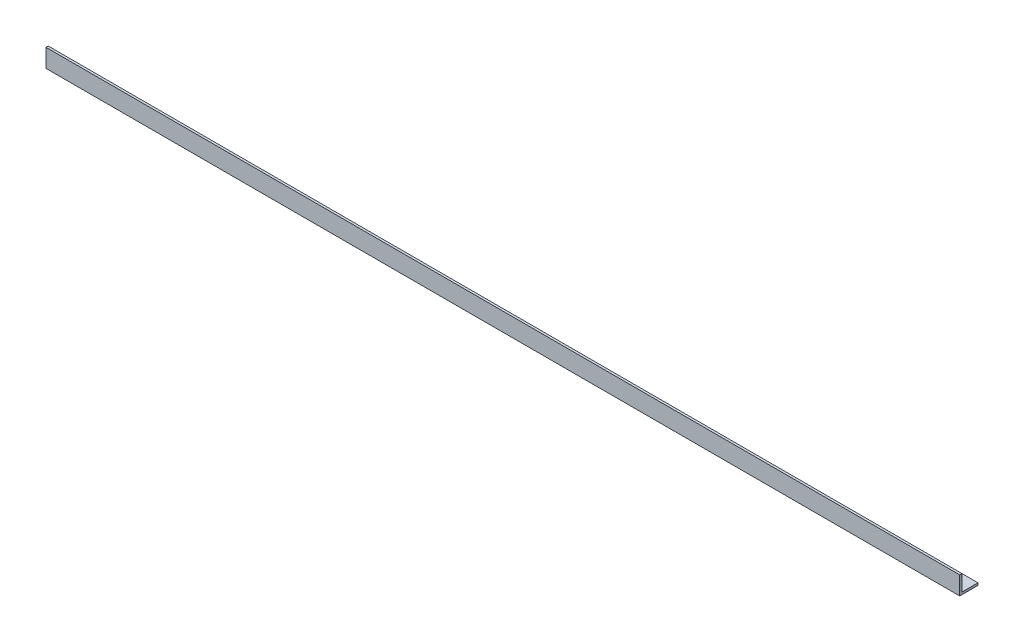
ISO-10303-21;
HEADER;
FILE_DESCRIPTION(('STEP AP214'),'2;1');
FILE_NAME('part.step','',(''),(''),'','','');
FILE_SCHEMA(('AUTOMOTIVE_DESIGN { 1 0 10303 214 1 1 1 1 }'));
ENDSEC;
DATA;
#1=APPLICATION_CONTEXT('core data for automotive mechanical design processes');
#2=APPLICATION_PROTOCOL_DEFINITION('international standard','automotive_design',2000,#1);
#3=PRODUCT_CONTEXT('',#1,'mechanical');
#4=PRODUCT('Part','Part','',(#3));
#5=PRODUCT_RELATED_PRODUCT_CATEGORY('part','',(#4));
#6=PRODUCT_DEFINITION_FORMATION('','',#4);
#7=PRODUCT_DEFINITION_CONTEXT('part definition',#1,'design');
#8=PRODUCT_DEFINITION('design','',#6,#7);
#9=PRODUCT_DEFINITION_SHAPE('','',#8);
#10=(LENGTH_UNIT() NAMED_UNIT(*) SI_UNIT(.MILLI.,.METRE.));
#11=(NAMED_UNIT(*) PLANE_ANGLE_UNIT() SI_UNIT($,.RADIAN.));
#12=(NAMED_UNIT(*) SI_UNIT($,.STERADIAN.) SOLID_ANGLE_UNIT());
#13=UNCERTAINTY_MEASURE_WITH_UNIT(LENGTH_MEASURE(1.E-05),#10,'distance_accuracy_value','');
#14=(GEOMETRIC_REPRESENTATION_CONTEXT(3) GLOBAL_UNCERTAINTY_ASSIGNED_CONTEXT((#13)) GLOBAL_UNIT_ASSIGNED_CONTEXT((#10,
#11,#12)) REPRESENTATION_CONTEXT('',''));
#15=CARTESIAN_POINT('',(0.,0.,0.));
#16=DIRECTION('',(0.,0.,1.));
#17=DIRECTION('',(1.,0.,0.));
#18=AXIS2_PLACEMENT_3D('',#15,#16,#17);
#19=CARTESIAN_POINT('',(-635.,3.175,-25.4));
#20=DIRECTION('',(0.,1.,0.));
#21=DIRECTION('',(0.,0.,1.));
#22=AXIS2_PLACEMENT_3D('',#19,#20,#21);
#23=PLANE('',#22);
#24=DIRECTION('',(-1.,0.,0.));
#25=VECTOR('',#24,1.);
#26=CARTESIAN_POINT('',(-635.,3.175,-25.4));
#27=LINE('',#26,#25);
#28=CARTESIAN_POINT('',(-635.,3.175,-25.4));
#29=VERTEX_POINT('',#28);
#30=CARTESIAN_POINT('',(635.,3.175,-25.4));
#31=VERTEX_POINT('',#30);
#32=EDGE_CURVE('E72',#29,#31,#27,.F.);
#33=ORIENTED_EDGE('',*,*,#32,.F.);
#34=DIRECTION('',(0.,0.,-1.));
#35=VECTOR('',#34,1.);
#36=CARTESIAN_POINT('',(-635.,3.175,0.));
#37=LINE('',#36,#35);
#38=CARTESIAN_POINT('',(-635.,3.175,-3.175));
#39=VERTEX_POINT('',#38);
#40=EDGE_CURVE('E104',#29,#39,#37,.F.);
#41=ORIENTED_EDGE('',*,*,#40,.T.);
#42=DIRECTION('',(-1.,0.,0.));
#43=VECTOR('',#42,1.);
#44=CARTESIAN_POINT('',(-635.,3.175,-3.175));
#45=LINE('',#44,#43);
#46=CARTESIAN_POINT('',(635.,3.175,-3.175));
#47=VERTEX_POINT('',#46);
#48=EDGE_CURVE('E20',#47,#39,#45,.T.);
#49=ORIENTED_EDGE('',*,*,#48,.F.);
#50=DIRECTION('',(0.,0.,-1.));
#51=VECTOR('',#50,1.);
#52=CARTESIAN_POINT('',(635.,3.175,0.));
#53=LINE('',#52,#51);
#54=EDGE_CURVE('E83',#31,#47,#53,.F.);
#55=ORIENTED_EDGE('',*,*,#54,.F.);
#56=EDGE_LOOP('',(#33,#41,#49,#55));
#57=FACE_BOUND('',#56,.T.);
#58=ADVANCED_FACE('F17',(#57),#23,.T.);
#59=CARTESIAN_POINT('',(-635.,3.175,-3.175));
#60=DIRECTION('',(0.,0.,-1.));
#61=DIRECTION('',(-1.,0.,0.));
#62=AXIS2_PLACEMENT_3D('',#59,#60,#61);
#63=PLANE('',#62);
#64=ORIENTED_EDGE('',*,*,#48,.T.);
#65=DIRECTION('',(0.,1.,0.));
#66=VECTOR('',#65,1.);
#67=CARTESIAN_POINT('',(-635.,0.,-3.175));
#68=LINE('',#67,#66);
#69=CARTESIAN_POINT('',(-635.,25.4,-3.175));
#70=VERTEX_POINT('',#69);
#71=EDGE_CURVE('E101',#39,#70,#68,.T.);
#72=ORIENTED_EDGE('',*,*,#71,.T.);
#73=DIRECTION('',(1.,0.,0.));
#74=VECTOR('',#73,1.);
#75=CARTESIAN_POINT('',(-635.,25.4,-3.175));
#76=LINE('',#75,#74);
#77=CARTESIAN_POINT('',(635.,25.4,-3.175));
#78=VERTEX_POINT('',#77);
#79=EDGE_CURVE('E80',#78,#70,#76,.F.);
#80=ORIENTED_EDGE('',*,*,#79,.F.);
#81=DIRECTION('',(0.,1.,0.));
#82=VECTOR('',#81,1.);
#83=CARTESIAN_POINT('',(635.,0.,-3.175));
#84=LINE('',#83,#82);
#85=EDGE_CURVE('E86',#47,#78,#84,.T.);
#86=ORIENTED_EDGE('',*,*,#85,.F.);
#87=EDGE_LOOP('',(#64,#72,#80,#86));
#88=FACE_BOUND('',#87,.T.);
#89=ADVANCED_FACE('F100',(#88),#63,.T.);
#90=CARTESIAN_POINT('',(-635.,25.4,-3.175));
#91=DIRECTION('',(0.,1.,0.));
#92=DIRECTION('',(0.,0.,1.));
#93=AXIS2_PLACEMENT_3D('',#90,#91,#92);
#94=PLANE('',#93);
#95=ORIENTED_EDGE('',*,*,#79,.T.);
#96=DIRECTION('',(0.,0.,-1.));
#97=VECTOR('',#96,1.);
#98=CARTESIAN_POINT('',(-635.,25.4,0.));
#99=LINE('',#98,#97);
#100=CARTESIAN_POINT('',(-635.,25.4,0.));
#101=VERTEX_POINT('',#100);
#102=EDGE_CURVE('E105',#70,#101,#99,.F.);
#103=ORIENTED_EDGE('',*,*,#102,.T.);
#104=DIRECTION('',(1.,0.,0.));
#105=VECTOR('',#104,1.);
#106=CARTESIAN_POINT('',(-635.,25.4,0.));
#107=LINE('',#106,#105);
#108=CARTESIAN_POINT('',(635.,25.4,0.));
#109=VERTEX_POINT('',#108);
#110=EDGE_CURVE('E112',#109,#101,#107,.F.);
#111=ORIENTED_EDGE('',*,*,#110,.F.);
#112=DIRECTION('',(0.,0.,-1.));
#113=VECTOR('',#112,1.);
#114=CARTESIAN_POINT('',(635.,25.4,0.));
#115=LINE('',#114,#113);
#116=EDGE_CURVE('E117',#78,#109,#115,.F.);
#117=ORIENTED_EDGE('',*,*,#116,.F.);
#118=EDGE_LOOP('',(#95,#103,#111,#117));
#119=FACE_BOUND('',#118,.T.);
#120=ADVANCED_FACE('F119',(#119),#94,.T.);
#121=CARTESIAN_POINT('',(-635.,0.,-25.4));
#122=DIRECTION('',(0.,0.,-1.));
#123=DIRECTION('',(-1.,0.,0.));
#124=AXIS2_PLACEMENT_3D('',#121,#122,#123);
#125=PLANE('',#124);
#126=DIRECTION('',(1.,0.,0.));
#127=VECTOR('',#126,1.);
#128=CARTESIAN_POINT('',(-635.,0.,-25.4));
#129=LINE('',#128,#127);
#130=CARTESIAN_POINT('',(-635.,0.,-25.4));
#131=VERTEX_POINT('',#130);
#132=CARTESIAN_POINT('',(635.,0.,-25.4));
#133=VERTEX_POINT('',#132);
#134=EDGE_CURVE('E125',#131,#133,#129,.T.);
#135=ORIENTED_EDGE('',*,*,#134,.F.);
#136=DIRECTION('',(0.,1.,0.));
#137=VECTOR('',#136,1.);
#138=CARTESIAN_POINT('',(-635.,0.,-25.4));
#139=LINE('',#138,#137);
#140=EDGE_CURVE('E78',#131,#29,#139,.T.);
#141=ORIENTED_EDGE('',*,*,#140,.T.);
#142=ORIENTED_EDGE('',*,*,#32,.T.);
#143=DIRECTION('',(0.,1.,0.));
#144=VECTOR('',#143,1.);
#145=CARTESIAN_POINT('',(635.,0.,-25.4));
#146=LINE('',#145,#144);
#147=EDGE_CURVE('E75',#133,#31,#146,.T.);
#148=ORIENTED_EDGE('',*,*,#147,.F.);
#149=EDGE_LOOP('',(#135,#141,#142,#148));
#150=FACE_BOUND('',#149,.T.);
#151=ADVANCED_FACE('F73',(#150),#125,.T.);
#152=CARTESIAN_POINT('',(635.,0.,0.));
#153=DIRECTION('',(1.,0.,0.));
#154=DIRECTION('',(0.,0.,-1.));
#155=AXIS2_PLACEMENT_3D('',#152,#153,#154);
#156=PLANE('',#155);
#157=DIRECTION('',(0.,1.,0.));
#158=VECTOR('',#157,1.);
#159=CARTESIAN_POINT('',(635.,25.4,0.));
#160=LINE('',#159,#158);
#161=CARTESIAN_POINT('',(635.,0.,0.));
#162=VERTEX_POINT('',#161);
#163=EDGE_CURVE('E114',#162,#109,#160,.T.);
#164=ORIENTED_EDGE('',*,*,#163,.F.);
#165=DIRECTION('',(0.,0.,-1.));
#166=VECTOR('',#165,1.);
#167=CARTESIAN_POINT('',(635.,0.,0.));
#168=LINE('',#167,#166);
#169=EDGE_CURVE('E90',#133,#162,#168,.F.);
#170=ORIENTED_EDGE('',*,*,#169,.F.);
#171=ORIENTED_EDGE('',*,*,#147,.T.);
#172=ORIENTED_EDGE('',*,*,#54,.T.);
#173=ORIENTED_EDGE('',*,*,#85,.T.);
#174=ORIENTED_EDGE('',*,*,#116,.T.);
#175=EDGE_LOOP('',(#164,#170,#171,#172,#173,#174));
#176=FACE_BOUND('',#175,.T.);
#177=ADVANCED_FACE('F88',(#176),#156,.T.);
#178=CARTESIAN_POINT('',(-635.,25.4,0.));
#179=DIRECTION('',(0.,0.,1.));
#180=DIRECTION('',(1.,0.,0.));
#181=AXIS2_PLACEMENT_3D('',#178,#179,#180);
#182=PLANE('',#181);
#183=ORIENTED_EDGE('',*,*,#110,.T.);
#184=DIRECTION('',(0.,1.,0.));
#185=VECTOR('',#184,1.);
#186=CARTESIAN_POINT('',(-635.,0.,0.));
#187=LINE('',#186,#185);
#188=CARTESIAN_POINT('',(-635.,0.,0.));
#189=VERTEX_POINT('',#188);
#190=EDGE_CURVE('E35',#101,#189,#187,.F.);
#191=ORIENTED_EDGE('',*,*,#190,.T.);
#192=DIRECTION('',(1.,0.,0.));
#193=VECTOR('',#192,1.);
#194=CARTESIAN_POINT('',(-635.,0.,0.));
#195=LINE('',#194,#193);
#196=EDGE_CURVE('E26',#162,#189,#195,.F.);
#197=ORIENTED_EDGE('',*,*,#196,.F.);
#198=ORIENTED_EDGE('',*,*,#163,.T.);
#199=EDGE_LOOP('',(#183,#191,#197,#198));
#200=FACE_BOUND('',#199,.T.);
#201=ADVANCED_FACE('F120',(#200),#182,.T.);
#202=CARTESIAN_POINT('',(-635.,0.,0.));
#203=DIRECTION('',(1.,0.,0.));
#204=DIRECTION('',(0.,0.,-1.));
#205=AXIS2_PLACEMENT_3D('',#202,#203,#204);
#206=PLANE('',#205);
#207=ORIENTED_EDGE('',*,*,#102,.F.);
#208=ORIENTED_EDGE('',*,*,#71,.F.);
#209=ORIENTED_EDGE('',*,*,#40,.F.);
#210=ORIENTED_EDGE('',*,*,#140,.F.);
#211=DIRECTION('',(0.,0.,-1.));
#212=VECTOR('',#211,1.);
#213=CARTESIAN_POINT('',(-635.,0.,0.));
#214=LINE('',#213,#212);
#215=EDGE_CURVE('E11',#189,#131,#214,.T.);
#216=ORIENTED_EDGE('',*,*,#215,.F.);
#217=ORIENTED_EDGE('',*,*,#190,.F.);
#218=EDGE_LOOP('',(#207,#208,#209,#210,#216,#217));
#219=FACE_BOUND('',#218,.T.);
#220=ADVANCED_FACE('F103',(#219),#206,.F.);
#221=CARTESIAN_POINT('',(-635.,0.,0.));
#222=DIRECTION('',(0.,-1.,0.));
#223=DIRECTION('',(0.,0.,-1.));
#224=AXIS2_PLACEMENT_3D('',#221,#222,#223);
#225=PLANE('',#224);
#226=ORIENTED_EDGE('',*,*,#196,.T.);
#227=ORIENTED_EDGE('',*,*,#215,.T.);
#228=ORIENTED_EDGE('',*,*,#134,.T.);
#229=ORIENTED_EDGE('',*,*,#169,.T.);
#230=EDGE_LOOP('',(#226,#227,#228,#229));
#231=FACE_BOUND('',#230,.T.);
#232=ADVANCED_FACE('F124',(#231),#225,.T.);
#233=CLOSED_SHELL('',(#58,#89,#120,#151,#177,#201,#220,#232));
#234=MANIFOLD_SOLID_BREP('B1',#233);
#235=ADVANCED_BREP_SHAPE_REPRESENTATION('',(#18,#234),#14);
#236=SHAPE_DEFINITION_REPRESENTATION(#9,#235);
ENDSEC;
END-ISO-10303-21;
